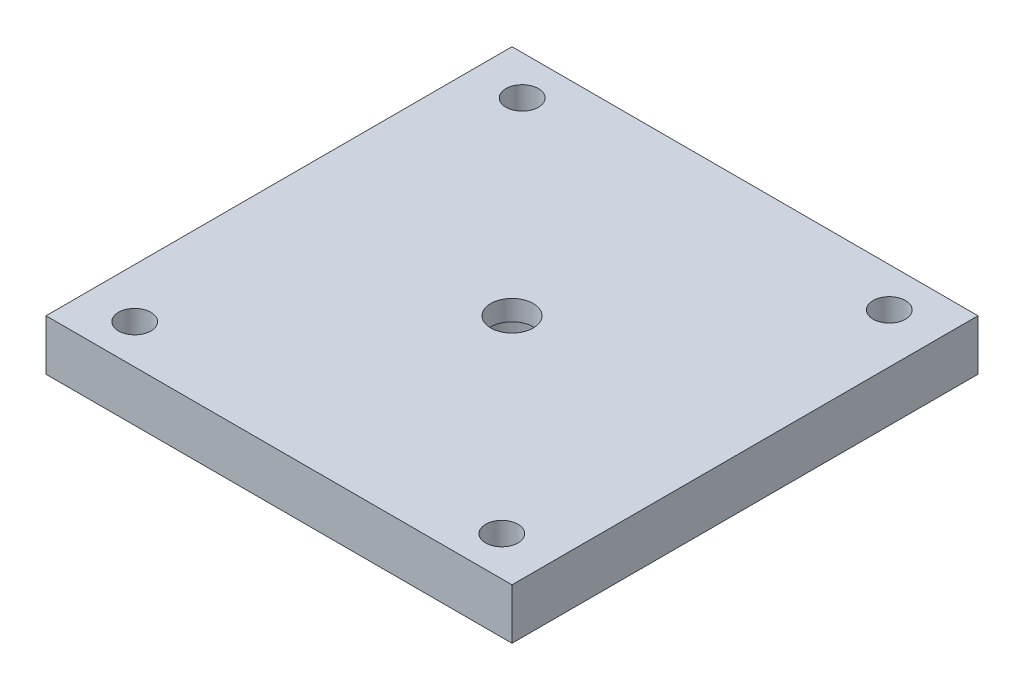
ISO-10303-21;
HEADER;
FILE_DESCRIPTION(('STEP AP214'),'2;1');
FILE_NAME('part.step','',(''),(''),'','','');
FILE_SCHEMA(('AUTOMOTIVE_DESIGN { 1 0 10303 214 1 1 1 1 }'));
ENDSEC;
DATA;
#1=APPLICATION_CONTEXT('core data for automotive mechanical design processes');
#2=APPLICATION_PROTOCOL_DEFINITION('international standard','automotive_design',2000,#1);
#3=PRODUCT_CONTEXT('',#1,'mechanical');
#4=PRODUCT('Part','Part','',(#3));
#5=PRODUCT_RELATED_PRODUCT_CATEGORY('part','',(#4));
#6=PRODUCT_DEFINITION_FORMATION('','',#4);
#7=PRODUCT_DEFINITION_CONTEXT('part definition',#1,'design');
#8=PRODUCT_DEFINITION('design','',#6,#7);
#9=PRODUCT_DEFINITION_SHAPE('','',#8);
#10=(LENGTH_UNIT() NAMED_UNIT(*) SI_UNIT(.MILLI.,.METRE.));
#11=(NAMED_UNIT(*) PLANE_ANGLE_UNIT() SI_UNIT($,.RADIAN.));
#12=(NAMED_UNIT(*) SI_UNIT($,.STERADIAN.) SOLID_ANGLE_UNIT());
#13=UNCERTAINTY_MEASURE_WITH_UNIT(LENGTH_MEASURE(1.E-05),#10,'distance_accuracy_value','');
#14=(GEOMETRIC_REPRESENTATION_CONTEXT(3) GLOBAL_UNCERTAINTY_ASSIGNED_CONTEXT((#13)) GLOBAL_UNIT_ASSIGNED_CONTEXT((#10,
#11,#12)) REPRESENTATION_CONTEXT('',''));
#15=CARTESIAN_POINT('',(0.,0.,0.));
#16=DIRECTION('',(0.,0.,1.));
#17=DIRECTION('',(1.,0.,0.));
#18=AXIS2_PLACEMENT_3D('',#15,#16,#17);
#19=CARTESIAN_POINT('',(23.,5.,23.));
#20=DIRECTION('',(-1.,0.,0.));
#21=DIRECTION('',(0.,0.,1.));
#22=AXIS2_PLACEMENT_3D('',#19,#20,#21);
#23=PLANE('',#22);
#24=DIRECTION('',(0.,0.,-1.));
#25=VECTOR('',#24,1.);
#26=CARTESIAN_POINT('',(23.,0.,23.));
#27=LINE('',#26,#25);
#28=CARTESIAN_POINT('',(23.,0.,23.));
#29=VERTEX_POINT('',#28);
#30=CARTESIAN_POINT('',(23.,0.,-23.));
#31=VERTEX_POINT('',#30);
#32=EDGE_CURVE('E99',#29,#31,#27,.T.);
#33=ORIENTED_EDGE('',*,*,#32,.T.);
#34=DIRECTION('',(0.,-1.,0.));
#35=VECTOR('',#34,1.);
#36=CARTESIAN_POINT('',(23.,5.,-23.));
#37=LINE('',#36,#35);
#38=CARTESIAN_POINT('',(23.,5.,-23.));
#39=VERTEX_POINT('',#38);
#40=EDGE_CURVE('E11',#39,#31,#37,.T.);
#41=ORIENTED_EDGE('',*,*,#40,.F.);
#42=DIRECTION('',(0.,0.,-1.));
#43=VECTOR('',#42,1.);
#44=CARTESIAN_POINT('',(23.,5.,23.));
#45=LINE('',#44,#43);
#46=CARTESIAN_POINT('',(23.,5.,23.));
#47=VERTEX_POINT('',#46);
#48=EDGE_CURVE('E86',#47,#39,#45,.T.);
#49=ORIENTED_EDGE('',*,*,#48,.F.);
#50=DIRECTION('',(0.,-1.,0.));
#51=VECTOR('',#50,1.);
#52=CARTESIAN_POINT('',(23.,5.,23.));
#53=LINE('',#52,#51);
#54=EDGE_CURVE('E95',#47,#29,#53,.T.);
#55=ORIENTED_EDGE('',*,*,#54,.T.);
#56=EDGE_LOOP('',(#33,#41,#49,#55));
#57=FACE_BOUND('',#56,.T.);
#58=ADVANCED_FACE('F34',(#57),#23,.F.);
#59=CARTESIAN_POINT('',(-23.,5.,-23.));
#60=DIRECTION('',(0.,0.,1.));
#61=DIRECTION('',(1.,0.,0.));
#62=AXIS2_PLACEMENT_3D('',#59,#60,#61);
#63=PLANE('',#62);
#64=DIRECTION('',(-1.,0.,0.));
#65=VECTOR('',#64,1.);
#66=CARTESIAN_POINT('',(-23.,0.,-23.));
#67=LINE('',#66,#65);
#68=CARTESIAN_POINT('',(-23.,0.,-23.));
#69=VERTEX_POINT('',#68);
#70=EDGE_CURVE('E90',#31,#69,#67,.T.);
#71=ORIENTED_EDGE('',*,*,#70,.T.);
#72=DIRECTION('',(0.,-1.,0.));
#73=VECTOR('',#72,1.);
#74=CARTESIAN_POINT('',(-23.,5.,-23.));
#75=LINE('',#74,#73);
#76=CARTESIAN_POINT('',(-23.,5.,-23.));
#77=VERTEX_POINT('',#76);
#78=EDGE_CURVE('E43',#77,#69,#75,.T.);
#79=ORIENTED_EDGE('',*,*,#78,.F.);
#80=DIRECTION('',(-1.,0.,0.));
#81=VECTOR('',#80,1.);
#82=CARTESIAN_POINT('',(-23.,5.,-23.));
#83=LINE('',#82,#81);
#84=EDGE_CURVE('E81',#39,#77,#83,.T.);
#85=ORIENTED_EDGE('',*,*,#84,.F.);
#86=ORIENTED_EDGE('',*,*,#40,.T.);
#87=EDGE_LOOP('',(#71,#79,#85,#86));
#88=FACE_BOUND('',#87,.T.);
#89=ADVANCED_FACE('F89',(#88),#63,.F.);
#90=CARTESIAN_POINT('',(-23.,5.,23.));
#91=DIRECTION('',(1.,0.,0.));
#92=DIRECTION('',(0.,0.,-1.));
#93=AXIS2_PLACEMENT_3D('',#90,#91,#92);
#94=PLANE('',#93);
#95=DIRECTION('',(0.,0.,1.));
#96=VECTOR('',#95,1.);
#97=CARTESIAN_POINT('',(-23.,0.,23.));
#98=LINE('',#97,#96);
#99=CARTESIAN_POINT('',(-23.,0.,23.));
#100=VERTEX_POINT('',#99);
#101=EDGE_CURVE('E68',#69,#100,#98,.T.);
#102=ORIENTED_EDGE('',*,*,#101,.T.);
#103=DIRECTION('',(0.,-1.,0.));
#104=VECTOR('',#103,1.);
#105=CARTESIAN_POINT('',(-23.,5.,23.));
#106=LINE('',#105,#104);
#107=CARTESIAN_POINT('',(-23.,5.,23.));
#108=VERTEX_POINT('',#107);
#109=EDGE_CURVE('E91',#108,#100,#106,.T.);
#110=ORIENTED_EDGE('',*,*,#109,.F.);
#111=DIRECTION('',(0.,0.,1.));
#112=VECTOR('',#111,1.);
#113=CARTESIAN_POINT('',(-23.,5.,23.));
#114=LINE('',#113,#112);
#115=EDGE_CURVE('E84',#77,#108,#114,.T.);
#116=ORIENTED_EDGE('',*,*,#115,.F.);
#117=ORIENTED_EDGE('',*,*,#78,.T.);
#118=EDGE_LOOP('',(#102,#110,#116,#117));
#119=FACE_BOUND('',#118,.T.);
#120=ADVANCED_FACE('F93',(#119),#94,.F.);
#121=CARTESIAN_POINT('',(-23.,5.,23.));
#122=DIRECTION('',(0.,0.,-1.));
#123=DIRECTION('',(-1.,0.,0.));
#124=AXIS2_PLACEMENT_3D('',#121,#122,#123);
#125=PLANE('',#124);
#126=DIRECTION('',(1.,0.,0.));
#127=VECTOR('',#126,1.);
#128=CARTESIAN_POINT('',(-23.,0.,23.));
#129=LINE('',#128,#127);
#130=EDGE_CURVE('E74',#100,#29,#129,.T.);
#131=ORIENTED_EDGE('',*,*,#130,.T.);
#132=ORIENTED_EDGE('',*,*,#54,.F.);
#133=DIRECTION('',(1.,0.,0.));
#134=VECTOR('',#133,1.);
#135=CARTESIAN_POINT('',(-23.,5.,23.));
#136=LINE('',#135,#134);
#137=EDGE_CURVE('E51',#108,#47,#136,.T.);
#138=ORIENTED_EDGE('',*,*,#137,.F.);
#139=ORIENTED_EDGE('',*,*,#109,.T.);
#140=EDGE_LOOP('',(#131,#132,#138,#139));
#141=FACE_BOUND('',#140,.T.);
#142=ADVANCED_FACE('F107',(#141),#125,.F.);
#143=CARTESIAN_POINT('',(0.,5.,0.));
#144=DIRECTION('',(0.,-1.,0.));
#145=DIRECTION('',(0.,0.,-1.));
#146=AXIS2_PLACEMENT_3D('',#143,#144,#145);
#147=PLANE('',#146);
#148=CARTESIAN_POINT('',(18.12,5.,19.125));
#149=DIRECTION('',(0.,1.,0.));
#150=DIRECTION('',(0.,0.,1.));
#151=AXIS2_PLACEMENT_3D('',#148,#149,#150);
#152=CIRCLE('',#151,1.6);
#153=CARTESIAN_POINT('',(18.12,5.,20.725));
#154=VERTEX_POINT('',#153);
#155=EDGE_CURVE('E131',#154,#154,#152,.T.);
#156=ORIENTED_EDGE('',*,*,#155,.F.);
#157=EDGE_LOOP('',(#156));
#158=FACE_BOUND('',#157,.T.);
#159=CARTESIAN_POINT('',(-18.12,5.,19.125));
#160=DIRECTION('',(0.,1.,0.));
#161=DIRECTION('',(0.,0.,1.));
#162=AXIS2_PLACEMENT_3D('',#159,#160,#161);
#163=CIRCLE('',#162,1.6);
#164=CARTESIAN_POINT('',(-18.12,5.,20.725));
#165=VERTEX_POINT('',#164);
#166=EDGE_CURVE('E137',#165,#165,#163,.T.);
#167=ORIENTED_EDGE('',*,*,#166,.F.);
#168=EDGE_LOOP('',(#167));
#169=FACE_BOUND('',#168,.T.);
#170=CARTESIAN_POINT('',(-18.12,5.,-19.125));
#171=DIRECTION('',(0.,1.,0.));
#172=DIRECTION('',(0.,0.,1.));
#173=AXIS2_PLACEMENT_3D('',#170,#171,#172);
#174=CIRCLE('',#173,1.6);
#175=CARTESIAN_POINT('',(-18.12,5.,-17.525));
#176=VERTEX_POINT('',#175);
#177=EDGE_CURVE('E125',#176,#176,#174,.T.);
#178=ORIENTED_EDGE('',*,*,#177,.F.);
#179=EDGE_LOOP('',(#178));
#180=FACE_BOUND('',#179,.T.);
#181=CARTESIAN_POINT('',(18.12,5.,-19.125));
#182=DIRECTION('',(0.,1.,0.));
#183=DIRECTION('',(0.,0.,1.));
#184=AXIS2_PLACEMENT_3D('',#181,#182,#183);
#185=CIRCLE('',#184,1.6);
#186=CARTESIAN_POINT('',(18.12,5.,-17.525));
#187=VERTEX_POINT('',#186);
#188=EDGE_CURVE('E121',#187,#187,#185,.T.);
#189=ORIENTED_EDGE('',*,*,#188,.F.);
#190=EDGE_LOOP('',(#189));
#191=FACE_BOUND('',#190,.T.);
#192=CARTESIAN_POINT('',(0.,5.,0.));
#193=DIRECTION('',(0.,1.,0.));
#194=DIRECTION('',(0.,0.,1.));
#195=AXIS2_PLACEMENT_3D('',#192,#193,#194);
#196=CIRCLE('',#195,2.1);
#197=CARTESIAN_POINT('',(0.,5.,2.1));
#198=VERTEX_POINT('',#197);
#199=EDGE_CURVE('E118',#198,#198,#196,.T.);
#200=ORIENTED_EDGE('',*,*,#199,.F.);
#201=EDGE_LOOP('',(#200));
#202=FACE_BOUND('',#201,.T.);
#203=ORIENTED_EDGE('',*,*,#48,.T.);
#204=ORIENTED_EDGE('',*,*,#84,.T.);
#205=ORIENTED_EDGE('',*,*,#115,.T.);
#206=ORIENTED_EDGE('',*,*,#137,.T.);
#207=EDGE_LOOP('',(#203,#204,#205,#206));
#208=FACE_BOUND('',#207,.T.);
#209=ADVANCED_FACE('F82',(#158,#169,#180,#191,#202,#208),#147,.F.);
#210=CARTESIAN_POINT('',(0.,0.,0.));
#211=DIRECTION('',(0.,-1.,0.));
#212=DIRECTION('',(0.,0.,-1.));
#213=AXIS2_PLACEMENT_3D('',#210,#211,#212);
#214=PLANE('',#213);
#215=CARTESIAN_POINT('',(18.12,0.,19.125));
#216=DIRECTION('',(0.,1.,0.));
#217=DIRECTION('',(0.,0.,1.));
#218=AXIS2_PLACEMENT_3D('',#215,#216,#217);
#219=CIRCLE('',#218,1.6);
#220=CARTESIAN_POINT('',(18.12,0.,20.725));
#221=VERTEX_POINT('',#220);
#222=EDGE_CURVE('E128',#221,#221,#219,.T.);
#223=ORIENTED_EDGE('',*,*,#222,.T.);
#224=EDGE_LOOP('',(#223));
#225=FACE_BOUND('',#224,.T.);
#226=CARTESIAN_POINT('',(-18.12,0.,19.125));
#227=DIRECTION('',(0.,1.,0.));
#228=DIRECTION('',(0.,0.,1.));
#229=AXIS2_PLACEMENT_3D('',#226,#227,#228);
#230=CIRCLE('',#229,1.6);
#231=CARTESIAN_POINT('',(-18.12,0.,20.725));
#232=VERTEX_POINT('',#231);
#233=EDGE_CURVE('E134',#232,#232,#230,.T.);
#234=ORIENTED_EDGE('',*,*,#233,.T.);
#235=EDGE_LOOP('',(#234));
#236=FACE_BOUND('',#235,.T.);
#237=CARTESIAN_POINT('',(-18.12,0.,-19.125));
#238=DIRECTION('',(0.,1.,0.));
#239=DIRECTION('',(0.,0.,1.));
#240=AXIS2_PLACEMENT_3D('',#237,#238,#239);
#241=CIRCLE('',#240,1.6);
#242=CARTESIAN_POINT('',(-18.12,0.,-17.525));
#243=VERTEX_POINT('',#242);
#244=EDGE_CURVE('E140',#243,#243,#241,.T.);
#245=ORIENTED_EDGE('',*,*,#244,.T.);
#246=EDGE_LOOP('',(#245));
#247=FACE_BOUND('',#246,.T.);
#248=CARTESIAN_POINT('',(18.12,0.,-19.125));
#249=DIRECTION('',(0.,1.,0.));
#250=DIRECTION('',(0.,0.,1.));
#251=AXIS2_PLACEMENT_3D('',#248,#249,#250);
#252=CIRCLE('',#251,1.6);
#253=CARTESIAN_POINT('',(18.12,0.,-17.525));
#254=VERTEX_POINT('',#253);
#255=EDGE_CURVE('E122',#254,#254,#252,.T.);
#256=ORIENTED_EDGE('',*,*,#255,.T.);
#257=EDGE_LOOP('',(#256));
#258=FACE_BOUND('',#257,.T.);
#259=CARTESIAN_POINT('',(0.,0.,0.));
#260=DIRECTION('',(0.,1.,0.));
#261=DIRECTION('',(0.,0.,1.));
#262=AXIS2_PLACEMENT_3D('',#259,#260,#261);
#263=CIRCLE('',#262,4.1);
#264=CARTESIAN_POINT('',(0.,0.,4.1));
#265=VERTEX_POINT('',#264);
#266=EDGE_CURVE('E113',#265,#265,#263,.T.);
#267=ORIENTED_EDGE('',*,*,#266,.T.);
#268=EDGE_LOOP('',(#267));
#269=FACE_BOUND('',#268,.T.);
#270=ORIENTED_EDGE('',*,*,#32,.F.);
#271=ORIENTED_EDGE('',*,*,#130,.F.);
#272=ORIENTED_EDGE('',*,*,#101,.F.);
#273=ORIENTED_EDGE('',*,*,#70,.F.);
#274=EDGE_LOOP('',(#270,#271,#272,#273));
#275=FACE_BOUND('',#274,.T.);
#276=ADVANCED_FACE('F110',(#225,#236,#247,#258,#269,#275),#214,.T.);
#277=CARTESIAN_POINT('',(0.,3.,0.));
#278=DIRECTION('',(0.,-1.,0.));
#279=DIRECTION('',(0.,0.,-1.));
#280=AXIS2_PLACEMENT_3D('',#277,#278,#279);
#281=CYLINDRICAL_SURFACE('',#280,4.1);
#282=CARTESIAN_POINT('',(0.,3.,0.));
#283=DIRECTION('',(0.,1.,0.));
#284=DIRECTION('',(0.,0.,1.));
#285=AXIS2_PLACEMENT_3D('',#282,#283,#284);
#286=CIRCLE('',#285,4.1);
#287=CARTESIAN_POINT('',(0.,3.,4.1));
#288=VERTEX_POINT('',#287);
#289=EDGE_CURVE('E102',#288,#288,#286,.T.);
#290=ORIENTED_EDGE('',*,*,#289,.T.);
#291=EDGE_LOOP('',(#290));
#292=FACE_BOUND('',#291,.T.);
#293=ORIENTED_EDGE('',*,*,#266,.F.);
#294=EDGE_LOOP('',(#293));
#295=FACE_BOUND('',#294,.T.);
#296=ADVANCED_FACE('F168',(#292,#295),#281,.F.);
#297=CARTESIAN_POINT('',(0.,3.,0.));
#298=DIRECTION('',(0.,1.,0.));
#299=DIRECTION('',(0.,0.,1.));
#300=AXIS2_PLACEMENT_3D('',#297,#298,#299);
#301=PLANE('',#300);
#302=CARTESIAN_POINT('',(0.,3.,0.));
#303=DIRECTION('',(0.,1.,0.));
#304=DIRECTION('',(0.,0.,1.));
#305=AXIS2_PLACEMENT_3D('',#302,#303,#304);
#306=CIRCLE('',#305,2.1);
#307=CARTESIAN_POINT('',(0.,3.,2.1));
#308=VERTEX_POINT('',#307);
#309=EDGE_CURVE('E37',#308,#308,#306,.F.);
#310=ORIENTED_EDGE('',*,*,#309,.F.);
#311=EDGE_LOOP('',(#310));
#312=FACE_BOUND('',#311,.T.);
#313=ORIENTED_EDGE('',*,*,#289,.F.);
#314=EDGE_LOOP('',(#313));
#315=FACE_BOUND('',#314,.T.);
#316=ADVANCED_FACE('F161',(#312,#315),#301,.F.);
#317=CARTESIAN_POINT('',(0.,5.,0.));
#318=DIRECTION('',(0.,-1.,0.));
#319=DIRECTION('',(0.,0.,-1.));
#320=AXIS2_PLACEMENT_3D('',#317,#318,#319);
#321=CYLINDRICAL_SURFACE('',#320,2.1);
#322=ORIENTED_EDGE('',*,*,#199,.T.);
#323=EDGE_LOOP('',(#322));
#324=FACE_BOUND('',#323,.T.);
#325=ORIENTED_EDGE('',*,*,#309,.T.);
#326=EDGE_LOOP('',(#325));
#327=FACE_BOUND('',#326,.T.);
#328=ADVANCED_FACE('F157',(#324,#327),#321,.F.);
#329=CARTESIAN_POINT('',(18.12,5.,-19.125));
#330=DIRECTION('',(0.,-1.,0.));
#331=DIRECTION('',(0.,0.,-1.));
#332=AXIS2_PLACEMENT_3D('',#329,#330,#331);
#333=CYLINDRICAL_SURFACE('',#332,1.6);
#334=ORIENTED_EDGE('',*,*,#188,.T.);
#335=EDGE_LOOP('',(#334));
#336=FACE_BOUND('',#335,.T.);
#337=ORIENTED_EDGE('',*,*,#255,.F.);
#338=EDGE_LOOP('',(#337));
#339=FACE_BOUND('',#338,.T.);
#340=ADVANCED_FACE('F160',(#336,#339),#333,.F.);
#341=CARTESIAN_POINT('',(-18.12,5.,-19.125));
#342=DIRECTION('',(0.,-1.,0.));
#343=DIRECTION('',(0.,0.,-1.));
#344=AXIS2_PLACEMENT_3D('',#341,#342,#343);
#345=CYLINDRICAL_SURFACE('',#344,1.6);
#346=ORIENTED_EDGE('',*,*,#177,.T.);
#347=EDGE_LOOP('',(#346));
#348=FACE_BOUND('',#347,.T.);
#349=ORIENTED_EDGE('',*,*,#244,.F.);
#350=EDGE_LOOP('',(#349));
#351=FACE_BOUND('',#350,.T.);
#352=ADVANCED_FACE('F146',(#348,#351),#345,.F.);
#353=CARTESIAN_POINT('',(-18.12,5.,19.125));
#354=DIRECTION('',(0.,-1.,0.));
#355=DIRECTION('',(0.,0.,-1.));
#356=AXIS2_PLACEMENT_3D('',#353,#354,#355);
#357=CYLINDRICAL_SURFACE('',#356,1.6);
#358=ORIENTED_EDGE('',*,*,#166,.T.);
#359=EDGE_LOOP('',(#358));
#360=FACE_BOUND('',#359,.T.);
#361=ORIENTED_EDGE('',*,*,#233,.F.);
#362=EDGE_LOOP('',(#361));
#363=FACE_BOUND('',#362,.T.);
#364=ADVANCED_FACE('F229',(#360,#363),#357,.F.);
#365=CARTESIAN_POINT('',(18.12,5.,19.125));
#366=DIRECTION('',(0.,-1.,0.));
#367=DIRECTION('',(0.,0.,-1.));
#368=AXIS2_PLACEMENT_3D('',#365,#366,#367);
#369=CYLINDRICAL_SURFACE('',#368,1.6);
#370=ORIENTED_EDGE('',*,*,#155,.T.);
#371=EDGE_LOOP('',(#370));
#372=FACE_BOUND('',#371,.T.);
#373=ORIENTED_EDGE('',*,*,#222,.F.);
#374=EDGE_LOOP('',(#373));
#375=FACE_BOUND('',#374,.T.);
#376=ADVANCED_FACE('F238',(#372,#375),#369,.F.);
#377=CLOSED_SHELL('',(#58,#89,#120,#142,#209,#276,#296,#316,#328,#340,#352,#364,#376));
#378=MANIFOLD_SOLID_BREP('B2',#377);
#379=ADVANCED_BREP_SHAPE_REPRESENTATION('',(#18,#378),#14);
#380=SHAPE_DEFINITION_REPRESENTATION(#9,#379);
ENDSEC;
END-ISO-10303-21;
